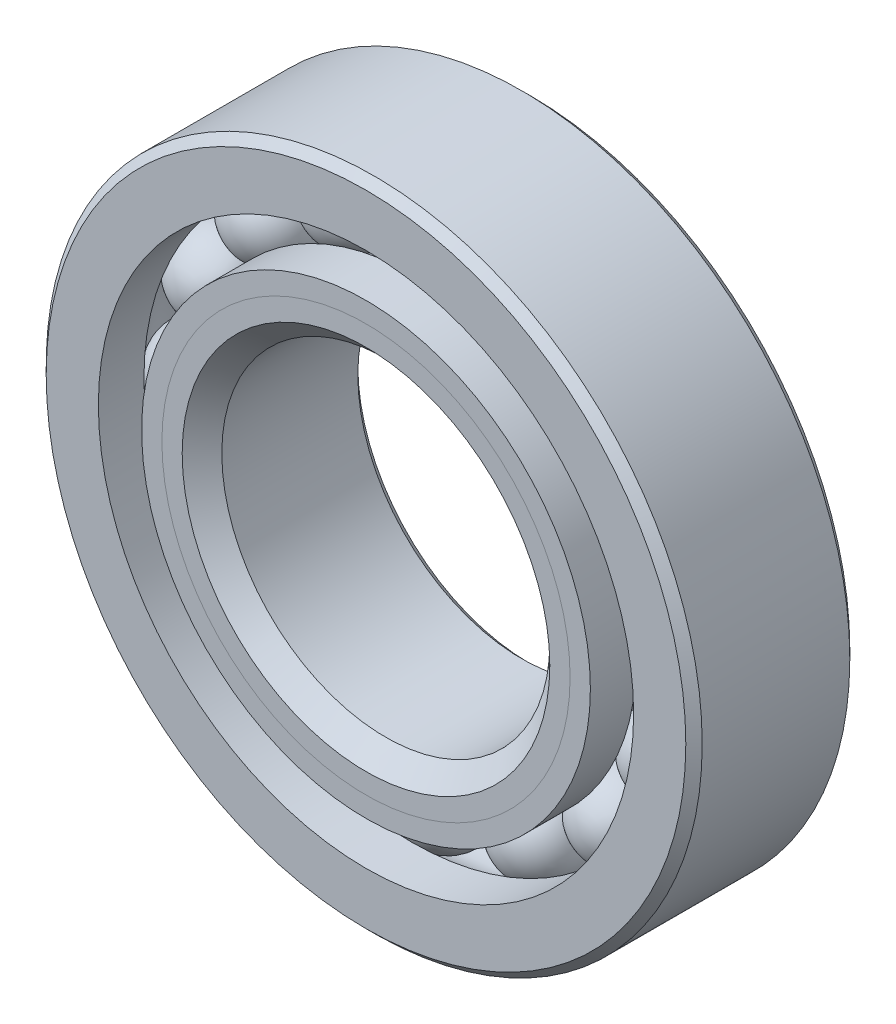
ISO-10303-21;
HEADER;
FILE_DESCRIPTION(('STEP AP214'),'2;1');
FILE_NAME('part.step','',(''),(''),'','','');
FILE_SCHEMA(('AUTOMOTIVE_DESIGN { 1 0 10303 214 1 1 1 1 }'));
ENDSEC;
DATA;
#1=APPLICATION_CONTEXT('core data for automotive mechanical design processes');
#2=APPLICATION_PROTOCOL_DEFINITION('international standard','automotive_design',2000,#1);
#3=PRODUCT_CONTEXT('',#1,'mechanical');
#4=PRODUCT('Part','Part','',(#3));
#5=PRODUCT_RELATED_PRODUCT_CATEGORY('part','',(#4));
#6=PRODUCT_DEFINITION_FORMATION('','',#4);
#7=PRODUCT_DEFINITION_CONTEXT('part definition',#1,'design');
#8=PRODUCT_DEFINITION('design','',#6,#7);
#9=PRODUCT_DEFINITION_SHAPE('','',#8);
#10=(LENGTH_UNIT() NAMED_UNIT(*) SI_UNIT(.MILLI.,.METRE.));
#11=(NAMED_UNIT(*) PLANE_ANGLE_UNIT() SI_UNIT($,.RADIAN.));
#12=(NAMED_UNIT(*) SI_UNIT($,.STERADIAN.) SOLID_ANGLE_UNIT());
#13=UNCERTAINTY_MEASURE_WITH_UNIT(LENGTH_MEASURE(1.E-05),#10,'distance_accuracy_value','');
#14=(GEOMETRIC_REPRESENTATION_CONTEXT(3) GLOBAL_UNCERTAINTY_ASSIGNED_CONTEXT((#13)) GLOBAL_UNIT_ASSIGNED_CONTEXT((#10,
#11,#12)) REPRESENTATION_CONTEXT('',''));
#15=CARTESIAN_POINT('',(0.,0.,0.));
#16=DIRECTION('',(0.,0.,1.));
#17=DIRECTION('',(1.,0.,0.));
#18=AXIS2_PLACEMENT_3D('',#15,#16,#17);
#19=CARTESIAN_POINT('',(-7.29011938655472,17.5999050943401,0.));
#20=DIRECTION('',(0.,0.,1.));
#21=DIRECTION('',(-0.382683432365077,0.923879532511292,0.));
#22=AXIS2_PLACEMENT_3D('',#19,#20,#21);
#23=SPHERICAL_SURFACE('',#22,3.28171342706955);
#24=CARTESIAN_POINT('',(-7.29011938655472,17.5999050943401,3.28171342706955));
#25=VERTEX_POINT('',#24);
#26=VERTEX_LOOP('',#25);
#27=FACE_BOUND('',#26,.T.);
#28=ADVANCED_FACE('F37',(#27),#23,.T.);
#29=CLOSED_SHELL('',(#28));
#30=MANIFOLD_SOLID_BREP('B2',#29);
#31=CARTESIAN_POINT('',(-13.4703841816036,13.4703841816039,0.));
#32=DIRECTION('',(0.,0.,1.));
#33=DIRECTION('',(-0.707106781186539,0.707106781186556,0.));
#34=AXIS2_PLACEMENT_3D('',#31,#32,#33);
#35=SPHERICAL_SURFACE('',#34,3.28171342706955);
#36=CARTESIAN_POINT('',(-13.4703841816036,13.4703841816039,3.28171342706955));
#37=VERTEX_POINT('',#36);
#38=VERTEX_LOOP('',#37);
#39=FACE_BOUND('',#38,.T.);
#40=ADVANCED_FACE('F58',(#39),#35,.T.);
#41=CLOSED_SHELL('',(#40));
#42=MANIFOLD_SOLID_BREP('B6',#41);
#43=CARTESIAN_POINT('',(-17.5999050943399,7.29011938655515,0.));
#44=DIRECTION('',(0.,0.,1.));
#45=DIRECTION('',(-0.923879532511283,0.3826834323651,0.));
#46=AXIS2_PLACEMENT_3D('',#43,#44,#45);
#47=SPHERICAL_SURFACE('',#46,3.28171342706955);
#48=CARTESIAN_POINT('',(-17.5999050943399,7.29011938655515,3.28171342706955));
#49=VERTEX_POINT('',#48);
#50=VERTEX_LOOP('',#49);
#51=FACE_BOUND('',#50,.T.);
#52=ADVANCED_FACE('F79',(#51),#47,.T.);
#53=CLOSED_SHELL('',(#52));
#54=MANIFOLD_SOLID_BREP('B33',#53);
#55=CARTESIAN_POINT('',(-19.05,1.99538274087401E-13,0.));
#56=DIRECTION('',(0.,0.,1.));
#57=DIRECTION('',(-1.,0.,0.));
#58=AXIS2_PLACEMENT_3D('',#55,#56,#57);
#59=SPHERICAL_SURFACE('',#58,3.28171342706955);
#60=CARTESIAN_POINT('',(-19.05,1.99538274087401E-13,3.28171342706955));
#61=VERTEX_POINT('',#60);
#62=VERTEX_LOOP('',#61);
#63=FACE_BOUND('',#62,.T.);
#64=ADVANCED_FACE('F100',(#63),#59,.T.);
#65=CLOSED_SHELL('',(#64));
#66=MANIFOLD_SOLID_BREP('B54',#65);
#67=CARTESIAN_POINT('',(-17.5999050943401,-7.29011938655478,0.));
#68=DIRECTION('',(0.,0.,1.));
#69=DIRECTION('',(-0.923879532511291,-0.382683432365081,0.));
#70=AXIS2_PLACEMENT_3D('',#67,#68,#69);
#71=SPHERICAL_SURFACE('',#70,3.28171342706955);
#72=CARTESIAN_POINT('',(-17.5999050943401,-7.29011938655478,3.28171342706955));
#73=VERTEX_POINT('',#72);
#74=VERTEX_LOOP('',#73);
#75=FACE_BOUND('',#74,.T.);
#76=ADVANCED_FACE('F121',(#75),#71,.T.);
#77=CLOSED_SHELL('',(#76));
#78=MANIFOLD_SOLID_BREP('B75',#77);
#79=CARTESIAN_POINT('',(-13.4703841816038,-13.4703841816036,0.));
#80=DIRECTION('',(0.,0.,1.));
#81=DIRECTION('',(-0.707106781186554,-0.707106781186541,0.));
#82=AXIS2_PLACEMENT_3D('',#79,#80,#81);
#83=SPHERICAL_SURFACE('',#82,3.28171342706955);
#84=CARTESIAN_POINT('',(-13.4703841816038,-13.4703841816036,3.28171342706955));
#85=VERTEX_POINT('',#84);
#86=VERTEX_LOOP('',#85);
#87=FACE_BOUND('',#86,.T.);
#88=ADVANCED_FACE('F142',(#87),#83,.T.);
#89=CLOSED_SHELL('',(#88));
#90=MANIFOLD_SOLID_BREP('B96',#89);
#91=CARTESIAN_POINT('',(-7.2901193865551,-17.59990509434,0.));
#92=DIRECTION('',(0.,0.,1.));
#93=DIRECTION('',(-0.382683432365097,-0.923879532511284,0.));
#94=AXIS2_PLACEMENT_3D('',#91,#92,#93);
#95=SPHERICAL_SURFACE('',#94,3.28171342706955);
#96=CARTESIAN_POINT('',(-7.2901193865551,-17.59990509434,3.28171342706955));
#97=VERTEX_POINT('',#96);
#98=VERTEX_LOOP('',#97);
#99=FACE_BOUND('',#98,.T.);
#100=ADVANCED_FACE('F163',(#99),#95,.T.);
#101=CLOSED_SHELL('',(#100));
#102=MANIFOLD_SOLID_BREP('B117',#101);
#103=CARTESIAN_POINT('',(-1.33025516058267E-13,-19.05,0.));
#104=DIRECTION('',(0.,0.,1.));
#105=DIRECTION('',(0.,-1.,0.));
#106=AXIS2_PLACEMENT_3D('',#103,#104,#105);
#107=SPHERICAL_SURFACE('',#106,3.28171342706955);
#108=CARTESIAN_POINT('',(-1.33025516058267E-13,-19.05,3.28171342706955));
#109=VERTEX_POINT('',#108);
#110=VERTEX_LOOP('',#109);
#111=FACE_BOUND('',#110,.T.);
#112=ADVANCED_FACE('F184',(#111),#107,.T.);
#113=CLOSED_SHELL('',(#112));
#114=MANIFOLD_SOLID_BREP('B138',#113);
#115=CARTESIAN_POINT('',(7.29011938655485,-17.5999050943401,0.));
#116=DIRECTION('',(0.,0.,1.));
#117=DIRECTION('',(0.382683432365084,-0.923879532511289,0.));
#118=AXIS2_PLACEMENT_3D('',#115,#116,#117);
#119=SPHERICAL_SURFACE('',#118,3.28171342706955);
#120=CARTESIAN_POINT('',(7.29011938655485,-17.5999050943401,3.28171342706955));
#121=VERTEX_POINT('',#120);
#122=VERTEX_LOOP('',#121);
#123=FACE_BOUND('',#122,.T.);
#124=ADVANCED_FACE('F205',(#123),#119,.T.);
#125=CLOSED_SHELL('',(#124));
#126=MANIFOLD_SOLID_BREP('B159',#125);
#127=CARTESIAN_POINT('',(13.4703841816037,-13.4703841816038,0.));
#128=DIRECTION('',(0.,0.,1.));
#129=DIRECTION('',(0.707106781186544,-0.707106781186551,0.));
#130=AXIS2_PLACEMENT_3D('',#127,#128,#129);
#131=SPHERICAL_SURFACE('',#130,3.28171342706955);
#132=CARTESIAN_POINT('',(13.4703841816037,-13.4703841816038,3.28171342706955));
#133=VERTEX_POINT('',#132);
#134=VERTEX_LOOP('',#133);
#135=FACE_BOUND('',#134,.T.);
#136=ADVANCED_FACE('F226',(#135),#131,.T.);
#137=CLOSED_SHELL('',(#136));
#138=MANIFOLD_SOLID_BREP('B180',#137);
#139=CARTESIAN_POINT('',(17.59990509434,-7.29011938655504,0.));
#140=DIRECTION('',(0.,0.,1.));
#141=DIRECTION('',(0.923879532511285,-0.382683432365094,0.));
#142=AXIS2_PLACEMENT_3D('',#139,#140,#141);
#143=SPHERICAL_SURFACE('',#142,3.28171342706955);
#144=CARTESIAN_POINT('',(17.59990509434,-7.29011938655504,3.28171342706955));
#145=VERTEX_POINT('',#144);
#146=VERTEX_LOOP('',#145);
#147=FACE_BOUND('',#146,.T.);
#148=ADVANCED_FACE('F247',(#147),#143,.T.);
#149=CLOSED_SHELL('',(#148));
#150=MANIFOLD_SOLID_BREP('B201',#149);
#151=CARTESIAN_POINT('',(19.05,0.,0.));
#152=DIRECTION('',(0.,0.,1.));
#153=DIRECTION('',(1.,0.,0.));
#154=AXIS2_PLACEMENT_3D('',#151,#152,#153);
#155=SPHERICAL_SURFACE('',#154,3.28171342706955);
#156=CARTESIAN_POINT('',(19.05,0.,3.28171342706955));
#157=VERTEX_POINT('',#156);
#158=VERTEX_LOOP('',#157);
#159=FACE_BOUND('',#158,.T.);
#160=ADVANCED_FACE('F268',(#159),#155,.T.);
#161=CLOSED_SHELL('',(#160));
#162=MANIFOLD_SOLID_BREP('B222',#161);
#163=CARTESIAN_POINT('',(17.59990509434,7.29011938655491,0.));
#164=DIRECTION('',(0.,0.,1.));
#165=DIRECTION('',(0.923879532511288,0.382683432365087,0.));
#166=AXIS2_PLACEMENT_3D('',#163,#164,#165);
#167=SPHERICAL_SURFACE('',#166,3.28171342706955);
#168=CARTESIAN_POINT('',(17.59990509434,7.29011938655491,3.28171342706955));
#169=VERTEX_POINT('',#168);
#170=VERTEX_LOOP('',#169);
#171=FACE_BOUND('',#170,.T.);
#172=ADVANCED_FACE('F289',(#171),#167,.T.);
#173=CLOSED_SHELL('',(#172));
#174=MANIFOLD_SOLID_BREP('B243',#173);
#175=CARTESIAN_POINT('',(13.4703841816038,13.4703841816037,0.));
#176=DIRECTION('',(0.,0.,1.));
#177=DIRECTION('',(0.707106781186549,0.707106781186546,0.));
#178=AXIS2_PLACEMENT_3D('',#175,#176,#177);
#179=SPHERICAL_SURFACE('',#178,3.28171342706955);
#180=CARTESIAN_POINT('',(13.4703841816038,13.4703841816037,3.28171342706955));
#181=VERTEX_POINT('',#180);
#182=VERTEX_LOOP('',#181);
#183=FACE_BOUND('',#182,.T.);
#184=ADVANCED_FACE('F310',(#183),#179,.T.);
#185=CLOSED_SHELL('',(#184));
#186=MANIFOLD_SOLID_BREP('B264',#185);
#187=CARTESIAN_POINT('',(7.29011938655498,17.59990509434,0.));
#188=DIRECTION('',(0.,0.,1.));
#189=DIRECTION('',(0.382683432365091,0.923879532511287,0.));
#190=AXIS2_PLACEMENT_3D('',#187,#188,#189);
#191=SPHERICAL_SURFACE('',#190,3.28171342706955);
#192=CARTESIAN_POINT('',(7.29011938655498,17.59990509434,3.28171342706955));
#193=VERTEX_POINT('',#192);
#194=VERTEX_LOOP('',#193);
#195=FACE_BOUND('',#194,.T.);
#196=ADVANCED_FACE('F331',(#195),#191,.T.);
#197=CLOSED_SHELL('',(#196));
#198=MANIFOLD_SOLID_BREP('B285',#197);
#199=CARTESIAN_POINT('',(0.,19.05,0.));
#200=DIRECTION('',(0.,0.,1.));
#201=DIRECTION('',(0.,1.,0.));
#202=AXIS2_PLACEMENT_3D('',#199,#200,#201);
#203=SPHERICAL_SURFACE('',#202,3.28171342706955);
#204=CARTESIAN_POINT('',(0.,19.05,3.28171342706955));
#205=VERTEX_POINT('',#204);
#206=VERTEX_LOOP('',#205);
#207=FACE_BOUND('',#206,.T.);
#208=ADVANCED_FACE('F353',(#207),#203,.T.);
#209=CLOSED_SHELL('',(#208));
#210=MANIFOLD_SOLID_BREP('B306',#209);
#211=CARTESIAN_POINT('',(0.,15.80470900587,6.35));
#212=DIRECTION('',(0.,0.,-1.));
#213=DIRECTION('',(-1.,0.,0.));
#214=AXIS2_PLACEMENT_3D('',#211,#212,#213);
#215=PLANE('',#214);
#216=CARTESIAN_POINT('',(0.,0.,6.35));
#217=DIRECTION('',(0.,0.,1.));
#218=DIRECTION('',(1.,0.,0.));
#219=AXIS2_PLACEMENT_3D('',#216,#217,#218);
#220=CIRCLE('',#219,14.2341432864652);
#221=CARTESIAN_POINT('',(14.2341432864652,0.,6.35));
#222=VERTEX_POINT('',#221);
#223=EDGE_CURVE('E408',#222,#222,#220,.T.);
#224=ORIENTED_EDGE('',*,*,#223,.F.);
#225=EDGE_LOOP('',(#224));
#226=FACE_BOUND('',#225,.T.);
#227=CARTESIAN_POINT('',(0.,0.,6.35));
#228=DIRECTION('',(0.,0.,1.));
#229=DIRECTION('',(1.,0.,0.));
#230=AXIS2_PLACEMENT_3D('',#227,#228,#229);
#231=CIRCLE('',#230,15.80470900587);
#232=CARTESIAN_POINT('',(15.80470900587,0.,6.35));
#233=VERTEX_POINT('',#232);
#234=EDGE_CURVE('E352',#233,#233,#231,.T.);
#235=ORIENTED_EDGE('',*,*,#234,.T.);
#236=EDGE_LOOP('',(#235));
#237=FACE_BOUND('',#236,.T.);
#238=ADVANCED_FACE('F374',(#226,#237),#215,.F.);
#239=CARTESIAN_POINT('',(0.,0.,4.77943428059525));
#240=DIRECTION('',(0.,0.,1.));
#241=DIRECTION('',(1.,0.,0.));
#242=AXIS2_PLACEMENT_3D('',#239,#240,#241);
#243=CONICAL_SURFACE('',#242,14.2341432864652,0.785398163397449);
#244=ORIENTED_EDGE('',*,*,#234,.F.);
#245=EDGE_LOOP('',(#244));
#246=FACE_BOUND('',#245,.T.);
#247=CARTESIAN_POINT('',(0.,0.,4.77943428059525));
#248=DIRECTION('',(0.,0.,1.));
#249=DIRECTION('',(1.,0.,0.));
#250=AXIS2_PLACEMENT_3D('',#247,#248,#249);
#251=CIRCLE('',#250,14.2341432864652);
#252=CARTESIAN_POINT('',(14.2341432864652,0.,4.77943428059525));
#253=VERTEX_POINT('',#252);
#254=EDGE_CURVE('E380',#253,#253,#251,.T.);
#255=ORIENTED_EDGE('',*,*,#254,.T.);
#256=EDGE_LOOP('',(#255));
#257=FACE_BOUND('',#256,.T.);
#258=ADVANCED_FACE('F415',(#246,#257),#243,.T.);
#259=CARTESIAN_POINT('',(0.,0.,6.35));
#260=DIRECTION('',(0.,0.,1.));
#261=DIRECTION('',(1.,0.,0.));
#262=AXIS2_PLACEMENT_3D('',#259,#260,#261);
#263=CYLINDRICAL_SURFACE('',#262,14.2341432864652);
#264=ORIENTED_EDGE('',*,*,#254,.F.);
#265=EDGE_LOOP('',(#264));
#266=FACE_BOUND('',#265,.T.);
#267=CARTESIAN_POINT('',(0.,0.,0.));
#268=DIRECTION('',(0.,0.,1.));
#269=DIRECTION('',(1.,0.,0.));
#270=AXIS2_PLACEMENT_3D('',#267,#268,#269);
#271=CIRCLE('',#270,14.2341432864652);
#272=CARTESIAN_POINT('',(14.2341432864652,0.,0.));
#273=VERTEX_POINT('',#272);
#274=EDGE_CURVE('E384',#273,#273,#271,.T.);
#275=ORIENTED_EDGE('',*,*,#274,.T.);
#276=EDGE_LOOP('',(#275));
#277=FACE_BOUND('',#276,.T.);
#278=ADVANCED_FACE('F419',(#266,#277),#263,.T.);
#279=CARTESIAN_POINT('',(0.,14.2341432864652,0.));
#280=DIRECTION('',(0.,0.,-1.));
#281=DIRECTION('',(-1.,0.,0.));
#282=AXIS2_PLACEMENT_3D('',#279,#280,#281);
#283=PLANE('',#282);
#284=ORIENTED_EDGE('',*,*,#274,.F.);
#285=EDGE_LOOP('',(#284));
#286=FACE_BOUND('',#285,.T.);
#287=CARTESIAN_POINT('',(0.,0.,0.));
#288=DIRECTION('',(0.,0.,1.));
#289=DIRECTION('',(1.,0.,0.));
#290=AXIS2_PLACEMENT_3D('',#287,#288,#289);
#291=CIRCLE('',#290,15.7682865729304);
#292=CARTESIAN_POINT('',(15.7682865729304,0.,0.));
#293=VERTEX_POINT('',#292);
#294=EDGE_CURVE('E388',#293,#293,#291,.T.);
#295=ORIENTED_EDGE('',*,*,#294,.T.);
#296=EDGE_LOOP('',(#295));
#297=FACE_BOUND('',#296,.T.);
#298=ADVANCED_FACE('F424',(#286,#297),#283,.F.);
#299=CARTESIAN_POINT('',(0.,0.,0.));
#300=DIRECTION('',(0.,0.,1.));
#301=DIRECTION('',(1.,0.,0.));
#302=AXIS2_PLACEMENT_3D('',#299,#300,#301);
#303=TOROIDAL_SURFACE('',#302,19.05,3.28171342706955);
#304=ORIENTED_EDGE('',*,*,#294,.F.);
#305=EDGE_LOOP('',(#304));
#306=FACE_BOUND('',#305,.T.);
#307=CARTESIAN_POINT('',(0.,0.,-2.82222222222222));
#308=DIRECTION('',(0.,0.,1.));
#309=DIRECTION('',(1.,0.,0.));
#310=AXIS2_PLACEMENT_3D('',#307,#308,#309);
#311=CIRCLE('',#310,17.3752747252747);
#312=CARTESIAN_POINT('',(17.3752747252747,0.,-2.82222222222222));
#313=VERTEX_POINT('',#312);
#314=EDGE_CURVE('E393',#313,#313,#311,.T.);
#315=ORIENTED_EDGE('',*,*,#314,.T.);
#316=EDGE_LOOP('',(#315));
#317=FACE_BOUND('',#316,.T.);
#318=ADVANCED_FACE('F430',(#306,#317),#303,.F.);
#319=CARTESIAN_POINT('',(0.,0.,6.35));
#320=DIRECTION('',(0.,0.,1.));
#321=DIRECTION('',(1.,0.,0.));
#322=AXIS2_PLACEMENT_3D('',#319,#320,#321);
#323=CYLINDRICAL_SURFACE('',#322,17.3752747252747);
#324=ORIENTED_EDGE('',*,*,#314,.F.);
#325=EDGE_LOOP('',(#324));
#326=FACE_BOUND('',#325,.T.);
#327=CARTESIAN_POINT('',(0.,0.,-6.35));
#328=DIRECTION('',(0.,0.,1.));
#329=DIRECTION('',(1.,0.,0.));
#330=AXIS2_PLACEMENT_3D('',#327,#328,#329);
#331=CIRCLE('',#330,17.3752747252747);
#332=CARTESIAN_POINT('',(17.3752747252747,0.,-6.35));
#333=VERTEX_POINT('',#332);
#334=EDGE_CURVE('E396',#333,#333,#331,.T.);
#335=ORIENTED_EDGE('',*,*,#334,.T.);
#336=EDGE_LOOP('',(#335));
#337=FACE_BOUND('',#336,.T.);
#338=ADVANCED_FACE('F434',(#326,#337),#323,.T.);
#339=CARTESIAN_POINT('',(0.,13.335,-6.35));
#340=DIRECTION('',(0.,0.,1.));
#341=DIRECTION('',(1.,0.,0.));
#342=AXIS2_PLACEMENT_3D('',#339,#340,#341);
#343=PLANE('',#342);
#344=ORIENTED_EDGE('',*,*,#334,.F.);
#345=EDGE_LOOP('',(#344));
#346=FACE_BOUND('',#345,.T.);
#347=CARTESIAN_POINT('',(0.,0.,-6.35));
#348=DIRECTION('',(0.,0.,1.));
#349=DIRECTION('',(1.,0.,0.));
#350=AXIS2_PLACEMENT_3D('',#347,#348,#349);
#351=CIRCLE('',#350,13.335);
#352=CARTESIAN_POINT('',(13.335,0.,-6.35));
#353=VERTEX_POINT('',#352);
#354=EDGE_CURVE('E399',#353,#353,#351,.T.);
#355=ORIENTED_EDGE('',*,*,#354,.T.);
#356=EDGE_LOOP('',(#355));
#357=FACE_BOUND('',#356,.T.);
#358=ADVANCED_FACE('F438',(#346,#357),#343,.F.);
#359=CARTESIAN_POINT('',(0.,0.,-5.715));
#360=DIRECTION('',(0.,0.,-1.));
#361=DIRECTION('',(-1.,0.,0.));
#362=AXIS2_PLACEMENT_3D('',#359,#360,#361);
#363=CONICAL_SURFACE('',#362,12.7,0.785398163397446);
#364=ORIENTED_EDGE('',*,*,#354,.F.);
#365=EDGE_LOOP('',(#364));
#366=FACE_BOUND('',#365,.T.);
#367=CARTESIAN_POINT('',(0.,0.,-5.715));
#368=DIRECTION('',(0.,0.,1.));
#369=DIRECTION('',(1.,0.,0.));
#370=AXIS2_PLACEMENT_3D('',#367,#368,#369);
#371=CIRCLE('',#370,12.7);
#372=CARTESIAN_POINT('',(12.7,0.,-5.715));
#373=VERTEX_POINT('',#372);
#374=EDGE_CURVE('E402',#373,#373,#371,.T.);
#375=ORIENTED_EDGE('',*,*,#374,.T.);
#376=EDGE_LOOP('',(#375));
#377=FACE_BOUND('',#376,.T.);
#378=ADVANCED_FACE('F442',(#366,#377),#363,.F.);
#379=CARTESIAN_POINT('',(0.,0.,6.35));
#380=DIRECTION('',(0.,0.,1.));
#381=DIRECTION('',(1.,0.,0.));
#382=AXIS2_PLACEMENT_3D('',#379,#380,#381);
#383=CYLINDRICAL_SURFACE('',#382,12.7);
#384=ORIENTED_EDGE('',*,*,#374,.F.);
#385=EDGE_LOOP('',(#384));
#386=FACE_BOUND('',#385,.T.);
#387=CARTESIAN_POINT('',(0.,0.,4.81585671353478));
#388=DIRECTION('',(0.,0.,1.));
#389=DIRECTION('',(1.,0.,0.));
#390=AXIS2_PLACEMENT_3D('',#387,#388,#389);
#391=CIRCLE('',#390,12.7);
#392=CARTESIAN_POINT('',(12.7,0.,4.81585671353478));
#393=VERTEX_POINT('',#392);
#394=EDGE_CURVE('E405',#393,#393,#391,.T.);
#395=ORIENTED_EDGE('',*,*,#394,.T.);
#396=EDGE_LOOP('',(#395));
#397=FACE_BOUND('',#396,.T.);
#398=ADVANCED_FACE('F446',(#386,#397),#383,.F.);
#399=CARTESIAN_POINT('',(0.,0.,6.35));
#400=DIRECTION('',(0.,0.,1.));
#401=DIRECTION('',(1.,0.,0.));
#402=AXIS2_PLACEMENT_3D('',#399,#400,#401);
#403=CONICAL_SURFACE('',#402,14.2341432864652,0.785398163397449);
#404=ORIENTED_EDGE('',*,*,#394,.F.);
#405=EDGE_LOOP('',(#404));
#406=FACE_BOUND('',#405,.T.);
#407=ORIENTED_EDGE('',*,*,#223,.T.);
#408=EDGE_LOOP('',(#407));
#409=FACE_BOUND('',#408,.T.);
#410=ADVANCED_FACE('F412',(#406,#409),#403,.F.);
#411=CLOSED_SHELL('',(#238,#258,#278,#298,#318,#338,#358,#378,#398,#410));
#412=MANIFOLD_SOLID_BREP('B327',#411);
#413=CARTESIAN_POINT('',(0.,17.3752747252747,6.35));
#414=DIRECTION('',(0.,0.,-1.));
#415=DIRECTION('',(-1.,0.,0.));
#416=AXIS2_PLACEMENT_3D('',#413,#414,#415);
#417=PLANE('',#416);
#418=CARTESIAN_POINT('',(0.,0.,6.35));
#419=DIRECTION('',(0.,0.,1.));
#420=DIRECTION('',(1.,0.,0.));
#421=AXIS2_PLACEMENT_3D('',#418,#419,#420);
#422=CIRCLE('',#421,15.80470900587);
#423=CARTESIAN_POINT('',(15.80470900587,0.,6.35));
#424=VERTEX_POINT('',#423);
#425=EDGE_CURVE('E373',#424,#424,#422,.T.);
#426=ORIENTED_EDGE('',*,*,#425,.F.);
#427=EDGE_LOOP('',(#426));
#428=FACE_BOUND('',#427,.T.);
#429=CARTESIAN_POINT('',(0.,0.,6.35));
#430=DIRECTION('',(0.,0.,1.));
#431=DIRECTION('',(1.,0.,0.));
#432=AXIS2_PLACEMENT_3D('',#429,#430,#431);
#433=CIRCLE('',#432,17.3752747252747);
#434=CARTESIAN_POINT('',(17.3752747252747,0.,6.35));
#435=VERTEX_POINT('',#434);
#436=EDGE_CURVE('E555',#435,#435,#433,.T.);
#437=ORIENTED_EDGE('',*,*,#436,.T.);
#438=EDGE_LOOP('',(#437));
#439=FACE_BOUND('',#438,.T.);
#440=ADVANCED_FACE('F533',(#428,#439),#417,.F.);
#441=CARTESIAN_POINT('',(0.,0.,6.35));
#442=DIRECTION('',(0.,0.,1.));
#443=DIRECTION('',(1.,0.,0.));
#444=AXIS2_PLACEMENT_3D('',#441,#442,#443);
#445=CONICAL_SURFACE('',#444,15.80470900587,0.785398163397449);
#446=CARTESIAN_POINT('',(0.,0.,4.77943428059525));
#447=DIRECTION('',(0.,0.,1.));
#448=DIRECTION('',(1.,0.,0.));
#449=AXIS2_PLACEMENT_3D('',#446,#447,#448);
#450=CIRCLE('',#449,14.2341432864652);
#451=CARTESIAN_POINT('',(14.2341432864652,0.,4.77943428059525));
#452=VERTEX_POINT('',#451);
#453=EDGE_CURVE('E539',#452,#452,#450,.T.);
#454=ORIENTED_EDGE('',*,*,#453,.F.);
#455=EDGE_LOOP('',(#454));
#456=FACE_BOUND('',#455,.T.);
#457=ORIENTED_EDGE('',*,*,#425,.T.);
#458=EDGE_LOOP('',(#457));
#459=FACE_BOUND('',#458,.T.);
#460=ADVANCED_FACE('F580',(#456,#459),#445,.F.);
#461=CARTESIAN_POINT('',(0.,0.,6.35));
#462=DIRECTION('',(0.,0.,1.));
#463=DIRECTION('',(1.,0.,0.));
#464=AXIS2_PLACEMENT_3D('',#461,#462,#463);
#465=CYLINDRICAL_SURFACE('',#464,14.2341432864652);
#466=CARTESIAN_POINT('',(0.,0.,0.));
#467=DIRECTION('',(0.,0.,1.));
#468=DIRECTION('',(1.,0.,0.));
#469=AXIS2_PLACEMENT_3D('',#466,#467,#468);
#470=CIRCLE('',#469,14.2341432864652);
#471=CARTESIAN_POINT('',(14.2341432864652,0.,0.));
#472=VERTEX_POINT('',#471);
#473=EDGE_CURVE('E543',#472,#472,#470,.T.);
#474=ORIENTED_EDGE('',*,*,#473,.F.);
#475=EDGE_LOOP('',(#474));
#476=FACE_BOUND('',#475,.T.);
#477=ORIENTED_EDGE('',*,*,#453,.T.);
#478=EDGE_LOOP('',(#477));
#479=FACE_BOUND('',#478,.T.);
#480=ADVANCED_FACE('F575',(#476,#479),#465,.F.);
#481=CARTESIAN_POINT('',(0.,14.2341432864652,0.));
#482=DIRECTION('',(0.,0.,1.));
#483=DIRECTION('',(1.,0.,0.));
#484=AXIS2_PLACEMENT_3D('',#481,#482,#483);
#485=PLANE('',#484);
#486=CARTESIAN_POINT('',(0.,0.,0.));
#487=DIRECTION('',(0.,0.,1.));
#488=DIRECTION('',(1.,0.,0.));
#489=AXIS2_PLACEMENT_3D('',#486,#487,#488);
#490=CIRCLE('',#489,15.7682865729304);
#491=CARTESIAN_POINT('',(15.7682865729304,0.,0.));
#492=VERTEX_POINT('',#491);
#493=EDGE_CURVE('E547',#492,#492,#490,.T.);
#494=ORIENTED_EDGE('',*,*,#493,.F.);
#495=EDGE_LOOP('',(#494));
#496=FACE_BOUND('',#495,.T.);
#497=ORIENTED_EDGE('',*,*,#473,.T.);
#498=EDGE_LOOP('',(#497));
#499=FACE_BOUND('',#498,.T.);
#500=ADVANCED_FACE('F569',(#496,#499),#485,.F.);
#501=CARTESIAN_POINT('',(0.,0.,0.));
#502=DIRECTION('',(0.,0.,1.));
#503=DIRECTION('',(1.,0.,0.));
#504=AXIS2_PLACEMENT_3D('',#501,#502,#503);
#505=TOROIDAL_SURFACE('',#504,19.05,3.28171342706955);
#506=CARTESIAN_POINT('',(0.,0.,2.82222222222222));
#507=DIRECTION('',(0.,0.,1.));
#508=DIRECTION('',(1.,0.,0.));
#509=AXIS2_PLACEMENT_3D('',#506,#507,#508);
#510=CIRCLE('',#509,17.3752747252747);
#511=CARTESIAN_POINT('',(17.3752747252747,0.,2.82222222222222));
#512=VERTEX_POINT('',#511);
#513=EDGE_CURVE('E552',#512,#512,#510,.T.);
#514=ORIENTED_EDGE('',*,*,#513,.F.);
#515=EDGE_LOOP('',(#514));
#516=FACE_BOUND('',#515,.T.);
#517=ORIENTED_EDGE('',*,*,#493,.T.);
#518=EDGE_LOOP('',(#517));
#519=FACE_BOUND('',#518,.T.);
#520=ADVANCED_FACE('F563',(#516,#519),#505,.F.);
#521=CARTESIAN_POINT('',(0.,0.,6.35));
#522=DIRECTION('',(0.,0.,1.));
#523=DIRECTION('',(1.,0.,0.));
#524=AXIS2_PLACEMENT_3D('',#521,#522,#523);
#525=CYLINDRICAL_SURFACE('',#524,17.3752747252747);
#526=ORIENTED_EDGE('',*,*,#436,.F.);
#527=EDGE_LOOP('',(#526));
#528=FACE_BOUND('',#527,.T.);
#529=ORIENTED_EDGE('',*,*,#513,.T.);
#530=EDGE_LOOP('',(#529));
#531=FACE_BOUND('',#530,.T.);
#532=ADVANCED_FACE('F560',(#528,#531),#525,.T.);
#533=CLOSED_SHELL('',(#440,#460,#480,#500,#520,#532));
#534=MANIFOLD_SOLID_BREP('B347',#533);
#535=CARTESIAN_POINT('',(0.,0.,5.715));
#536=DIRECTION('',(0.,0.,-1.));
#537=DIRECTION('',(-1.,0.,0.));
#538=AXIS2_PLACEMENT_3D('',#535,#536,#537);
#539=CONICAL_SURFACE('',#538,25.4,0.785398163397443);
#540=CARTESIAN_POINT('',(0.,0.,6.35));
#541=DIRECTION('',(0.,0.,1.));
#542=DIRECTION('',(1.,0.,0.));
#543=AXIS2_PLACEMENT_3D('',#540,#541,#542);
#544=CIRCLE('',#543,24.765);
#545=CARTESIAN_POINT('',(24.765,0.,6.35));
#546=VERTEX_POINT('',#545);
#547=EDGE_CURVE('E653',#546,#546,#544,.T.);
#548=ORIENTED_EDGE('',*,*,#547,.F.);
#549=EDGE_LOOP('',(#548));
#550=FACE_BOUND('',#549,.T.);
#551=CARTESIAN_POINT('',(0.,0.,5.715));
#552=DIRECTION('',(0.,0.,1.));
#553=DIRECTION('',(1.,0.,0.));
#554=AXIS2_PLACEMENT_3D('',#551,#552,#553);
#555=CIRCLE('',#554,25.4);
#556=CARTESIAN_POINT('',(25.4,0.,5.715));
#557=VERTEX_POINT('',#556);
#558=EDGE_CURVE('E532',#557,#557,#555,.T.);
#559=ORIENTED_EDGE('',*,*,#558,.T.);
#560=EDGE_LOOP('',(#559));
#561=FACE_BOUND('',#560,.T.);
#562=ADVANCED_FACE('F625',(#550,#561),#539,.T.);
#563=CARTESIAN_POINT('',(0.,0.,6.35));
#564=DIRECTION('',(0.,0.,1.));
#565=DIRECTION('',(1.,0.,0.));
#566=AXIS2_PLACEMENT_3D('',#563,#564,#565);
#567=CYLINDRICAL_SURFACE('',#566,25.4);
#568=ORIENTED_EDGE('',*,*,#558,.F.);
#569=EDGE_LOOP('',(#568));
#570=FACE_BOUND('',#569,.T.);
#571=CARTESIAN_POINT('',(0.,0.,-5.715));
#572=DIRECTION('',(0.,0.,1.));
#573=DIRECTION('',(1.,0.,0.));
#574=AXIS2_PLACEMENT_3D('',#571,#572,#573);
#575=CIRCLE('',#574,25.4);
#576=CARTESIAN_POINT('',(25.4,0.,-5.715));
#577=VERTEX_POINT('',#576);
#578=EDGE_CURVE('E631',#577,#577,#575,.T.);
#579=ORIENTED_EDGE('',*,*,#578,.T.);
#580=EDGE_LOOP('',(#579));
#581=FACE_BOUND('',#580,.T.);
#582=ADVANCED_FACE('F660',(#570,#581),#567,.T.);
#583=CARTESIAN_POINT('',(0.,0.,-6.35));
#584=DIRECTION('',(0.,0.,1.));
#585=DIRECTION('',(1.,0.,0.));
#586=AXIS2_PLACEMENT_3D('',#583,#584,#585);
#587=CONICAL_SURFACE('',#586,24.765,0.785398163397443);
#588=ORIENTED_EDGE('',*,*,#578,.F.);
#589=EDGE_LOOP('',(#588));
#590=FACE_BOUND('',#589,.T.);
#591=CARTESIAN_POINT('',(0.,0.,-6.35));
#592=DIRECTION('',(0.,0.,1.));
#593=DIRECTION('',(1.,0.,0.));
#594=AXIS2_PLACEMENT_3D('',#591,#592,#593);
#595=CIRCLE('',#594,24.765);
#596=CARTESIAN_POINT('',(24.765,0.,-6.35));
#597=VERTEX_POINT('',#596);
#598=EDGE_CURVE('E635',#597,#597,#595,.T.);
#599=ORIENTED_EDGE('',*,*,#598,.T.);
#600=EDGE_LOOP('',(#599));
#601=FACE_BOUND('',#600,.T.);
#602=ADVANCED_FACE('F664',(#590,#601),#587,.T.);
#603=CARTESIAN_POINT('',(0.,24.765,-6.35));
#604=DIRECTION('',(0.,0.,1.));
#605=DIRECTION('',(1.,0.,0.));
#606=AXIS2_PLACEMENT_3D('',#603,#604,#605);
#607=PLANE('',#606);
#608=ORIENTED_EDGE('',*,*,#598,.F.);
#609=EDGE_LOOP('',(#608));
#610=FACE_BOUND('',#609,.T.);
#611=CARTESIAN_POINT('',(0.,0.,-6.35));
#612=DIRECTION('',(0.,0.,1.));
#613=DIRECTION('',(1.,0.,0.));
#614=AXIS2_PLACEMENT_3D('',#611,#612,#613);
#615=CIRCLE('',#614,20.7247252747253);
#616=CARTESIAN_POINT('',(20.7247252747253,0.,-6.35));
#617=VERTEX_POINT('',#616);
#618=EDGE_CURVE('E639',#617,#617,#615,.T.);
#619=ORIENTED_EDGE('',*,*,#618,.T.);
#620=EDGE_LOOP('',(#619));
#621=FACE_BOUND('',#620,.T.);
#622=ADVANCED_FACE('F669',(#610,#621),#607,.F.);
#623=CARTESIAN_POINT('',(0.,0.,6.35));
#624=DIRECTION('',(0.,0.,1.));
#625=DIRECTION('',(1.,0.,0.));
#626=AXIS2_PLACEMENT_3D('',#623,#624,#625);
#627=CYLINDRICAL_SURFACE('',#626,20.7247252747253);
#628=ORIENTED_EDGE('',*,*,#618,.F.);
#629=EDGE_LOOP('',(#628));
#630=FACE_BOUND('',#629,.T.);
#631=CARTESIAN_POINT('',(0.,0.,-2.82222222222222));
#632=DIRECTION('',(0.,0.,1.));
#633=DIRECTION('',(1.,0.,0.));
#634=AXIS2_PLACEMENT_3D('',#631,#632,#633);
#635=CIRCLE('',#634,20.7247252747253);
#636=CARTESIAN_POINT('',(20.7247252747253,0.,-2.82222222222222));
#637=VERTEX_POINT('',#636);
#638=EDGE_CURVE('E644',#637,#637,#635,.T.);
#639=ORIENTED_EDGE('',*,*,#638,.T.);
#640=EDGE_LOOP('',(#639));
#641=FACE_BOUND('',#640,.T.);
#642=ADVANCED_FACE('F675',(#630,#641),#627,.F.);
#643=CARTESIAN_POINT('',(0.,0.,0.));
#644=DIRECTION('',(0.,0.,1.));
#645=DIRECTION('',(1.,0.,0.));
#646=AXIS2_PLACEMENT_3D('',#643,#644,#645);
#647=TOROIDAL_SURFACE('',#646,19.05,3.28171342706955);
#648=ORIENTED_EDGE('',*,*,#638,.F.);
#649=EDGE_LOOP('',(#648));
#650=FACE_BOUND('',#649,.T.);
#651=CARTESIAN_POINT('',(0.,0.,2.82222222222222));
#652=DIRECTION('',(0.,0.,1.));
#653=DIRECTION('',(1.,0.,0.));
#654=AXIS2_PLACEMENT_3D('',#651,#652,#653);
#655=CIRCLE('',#654,20.7247252747253);
#656=CARTESIAN_POINT('',(20.7247252747253,0.,2.82222222222222));
#657=VERTEX_POINT('',#656);
#658=EDGE_CURVE('E647',#657,#657,#655,.T.);
#659=ORIENTED_EDGE('',*,*,#658,.T.);
#660=EDGE_LOOP('',(#659));
#661=FACE_BOUND('',#660,.T.);
#662=ADVANCED_FACE('F679',(#650,#661),#647,.F.);
#663=CARTESIAN_POINT('',(0.,0.,6.35));
#664=DIRECTION('',(0.,0.,1.));
#665=DIRECTION('',(1.,0.,0.));
#666=AXIS2_PLACEMENT_3D('',#663,#664,#665);
#667=CYLINDRICAL_SURFACE('',#666,20.7247252747253);
#668=ORIENTED_EDGE('',*,*,#658,.F.);
#669=EDGE_LOOP('',(#668));
#670=FACE_BOUND('',#669,.T.);
#671=CARTESIAN_POINT('',(0.,0.,6.35));
#672=DIRECTION('',(0.,0.,1.));
#673=DIRECTION('',(1.,0.,0.));
#674=AXIS2_PLACEMENT_3D('',#671,#672,#673);
#675=CIRCLE('',#674,20.7247252747253);
#676=CARTESIAN_POINT('',(20.7247252747253,0.,6.35));
#677=VERTEX_POINT('',#676);
#678=EDGE_CURVE('E650',#677,#677,#675,.T.);
#679=ORIENTED_EDGE('',*,*,#678,.T.);
#680=EDGE_LOOP('',(#679));
#681=FACE_BOUND('',#680,.T.);
#682=ADVANCED_FACE('F683',(#670,#681),#667,.F.);
#683=CARTESIAN_POINT('',(0.,24.765,6.35));
#684=DIRECTION('',(0.,0.,-1.));
#685=DIRECTION('',(-1.,0.,0.));
#686=AXIS2_PLACEMENT_3D('',#683,#684,#685);
#687=PLANE('',#686);
#688=ORIENTED_EDGE('',*,*,#678,.F.);
#689=EDGE_LOOP('',(#688));
#690=FACE_BOUND('',#689,.T.);
#691=ORIENTED_EDGE('',*,*,#547,.T.);
#692=EDGE_LOOP('',(#691));
#693=FACE_BOUND('',#692,.T.);
#694=ADVANCED_FACE('F657',(#690,#693),#687,.F.);
#695=CLOSED_SHELL('',(#562,#582,#602,#622,#642,#662,#682,#694));
#696=MANIFOLD_SOLID_BREP('B368',#695);
#697=ADVANCED_BREP_SHAPE_REPRESENTATION('',(#18,#30,#42,#54,#66,#78,#90,#102,#114,#126,#138,
#150,#162,#174,#186,#198,#210,#412,#534,#696),#14);
#698=SHAPE_DEFINITION_REPRESENTATION(#9,#697);
ENDSEC;
END-ISO-10303-21;
